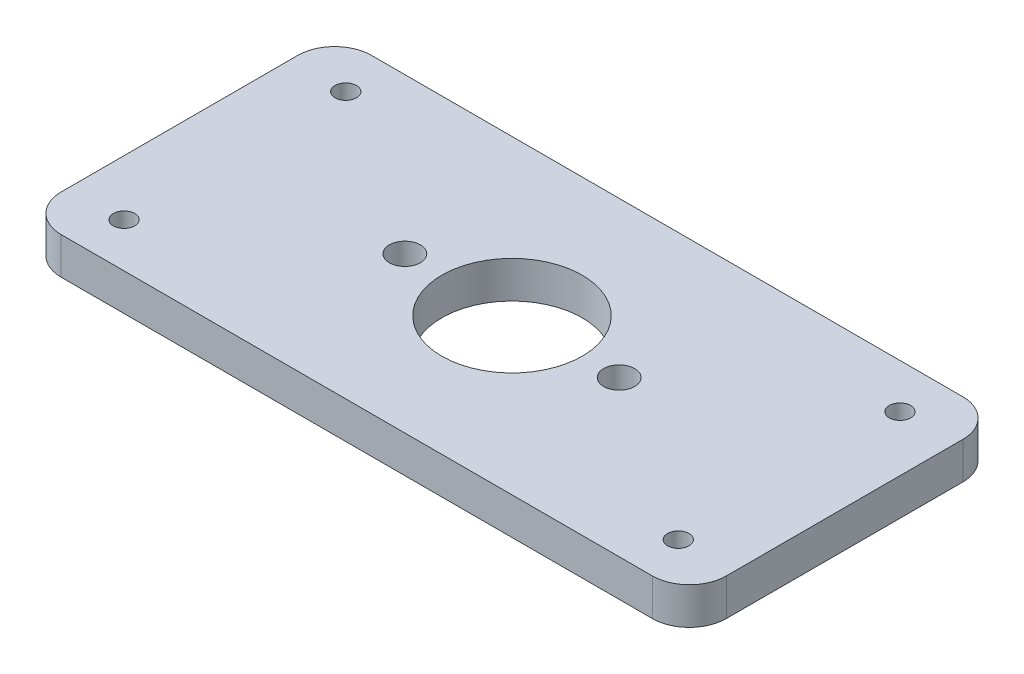
ISO-10303-21;
HEADER;
FILE_DESCRIPTION(('STEP AP214'),'2;1');
FILE_NAME('part.step','',(''),(''),'','','');
FILE_SCHEMA(('AUTOMOTIVE_DESIGN { 1 0 10303 214 1 1 1 1 }'));
ENDSEC;
DATA;
#1=APPLICATION_CONTEXT('core data for automotive mechanical design processes');
#2=APPLICATION_PROTOCOL_DEFINITION('international standard','automotive_design',2000,#1);
#3=PRODUCT_CONTEXT('',#1,'mechanical');
#4=PRODUCT('Part','Part','',(#3));
#5=PRODUCT_RELATED_PRODUCT_CATEGORY('part','',(#4));
#6=PRODUCT_DEFINITION_FORMATION('','',#4);
#7=PRODUCT_DEFINITION_CONTEXT('part definition',#1,'design');
#8=PRODUCT_DEFINITION('design','',#6,#7);
#9=PRODUCT_DEFINITION_SHAPE('','',#8);
#10=(LENGTH_UNIT() NAMED_UNIT(*) SI_UNIT(.MILLI.,.METRE.));
#11=(NAMED_UNIT(*) PLANE_ANGLE_UNIT() SI_UNIT($,.RADIAN.));
#12=(NAMED_UNIT(*) SI_UNIT($,.STERADIAN.) SOLID_ANGLE_UNIT());
#13=UNCERTAINTY_MEASURE_WITH_UNIT(LENGTH_MEASURE(1.E-05),#10,'distance_accuracy_value','');
#14=(GEOMETRIC_REPRESENTATION_CONTEXT(3) GLOBAL_UNCERTAINTY_ASSIGNED_CONTEXT((#13)) GLOBAL_UNIT_ASSIGNED_CONTEXT((#10,
#11,#12)) REPRESENTATION_CONTEXT('',''));
#15=CARTESIAN_POINT('',(0.,0.,0.));
#16=DIRECTION('',(0.,0.,1.));
#17=DIRECTION('',(1.,0.,0.));
#18=AXIS2_PLACEMENT_3D('',#15,#16,#17);
#19=CARTESIAN_POINT('',(0.,5.,0.));
#20=DIRECTION('',(0.,-1.,0.));
#21=DIRECTION('',(0.,0.,-1.));
#22=AXIS2_PLACEMENT_3D('',#19,#20,#21);
#23=PLANE('',#22);
#24=DIRECTION('',(0.,0.,-1.));
#25=VECTOR('',#24,1.);
#26=CARTESIAN_POINT('',(90.,5.,0.));
#27=LINE('',#26,#25);
#28=CARTESIAN_POINT('',(90.,5.,-5.));
#29=VERTEX_POINT('',#28);
#30=CARTESIAN_POINT('',(90.,5.,-37.));
#31=VERTEX_POINT('',#30);
#32=EDGE_CURVE('E206',#29,#31,#27,.T.);
#33=ORIENTED_EDGE('',*,*,#32,.T.);
#34=CARTESIAN_POINT('',(85.,5.,-37.));
#35=DIRECTION('',(0.,-1.,0.));
#36=DIRECTION('',(0.,0.,-1.));
#37=AXIS2_PLACEMENT_3D('',#34,#35,#36);
#38=CIRCLE('',#37,5.);
#39=CARTESIAN_POINT('',(85.,5.,-42.));
#40=VERTEX_POINT('',#39);
#41=EDGE_CURVE('E175',#31,#40,#38,.F.);
#42=ORIENTED_EDGE('',*,*,#41,.T.);
#43=DIRECTION('',(-1.,0.,0.));
#44=VECTOR('',#43,1.);
#45=CARTESIAN_POINT('',(0.,5.,-42.));
#46=LINE('',#45,#44);
#47=CARTESIAN_POINT('',(5.,5.,-42.));
#48=VERTEX_POINT('',#47);
#49=EDGE_CURVE('E133',#40,#48,#46,.T.);
#50=ORIENTED_EDGE('',*,*,#49,.T.);
#51=CARTESIAN_POINT('',(5.,5.,-37.));
#52=DIRECTION('',(0.,-1.,0.));
#53=DIRECTION('',(0.,0.,-1.));
#54=AXIS2_PLACEMENT_3D('',#51,#52,#53);
#55=CIRCLE('',#54,5.);
#56=CARTESIAN_POINT('',(0.,5.,-37.));
#57=VERTEX_POINT('',#56);
#58=EDGE_CURVE('E167',#48,#57,#55,.F.);
#59=ORIENTED_EDGE('',*,*,#58,.T.);
#60=DIRECTION('',(0.,0.,1.));
#61=VECTOR('',#60,1.);
#62=CARTESIAN_POINT('',(0.,5.,0.));
#63=LINE('',#62,#61);
#64=CARTESIAN_POINT('',(0.,5.,-5.));
#65=VERTEX_POINT('',#64);
#66=EDGE_CURVE('E142',#57,#65,#63,.T.);
#67=ORIENTED_EDGE('',*,*,#66,.T.);
#68=CARTESIAN_POINT('',(5.,5.,-5.));
#69=DIRECTION('',(0.,-1.,0.));
#70=DIRECTION('',(0.,0.,-1.));
#71=AXIS2_PLACEMENT_3D('',#68,#69,#70);
#72=CIRCLE('',#71,5.);
#73=CARTESIAN_POINT('',(5.,5.,0.));
#74=VERTEX_POINT('',#73);
#75=EDGE_CURVE('E68',#65,#74,#72,.F.);
#76=ORIENTED_EDGE('',*,*,#75,.T.);
#77=DIRECTION('',(1.,0.,0.));
#78=VECTOR('',#77,1.);
#79=CARTESIAN_POINT('',(0.,5.,0.));
#80=LINE('',#79,#78);
#81=CARTESIAN_POINT('',(85.,5.,0.));
#82=VERTEX_POINT('',#81);
#83=EDGE_CURVE('E147',#74,#82,#80,.T.);
#84=ORIENTED_EDGE('',*,*,#83,.T.);
#85=CARTESIAN_POINT('',(85.,5.,-5.));
#86=DIRECTION('',(0.,-1.,0.));
#87=DIRECTION('',(0.,0.,-1.));
#88=AXIS2_PLACEMENT_3D('',#85,#86,#87);
#89=CIRCLE('',#88,5.);
#90=EDGE_CURVE('E172',#82,#29,#89,.F.);
#91=ORIENTED_EDGE('',*,*,#90,.T.);
#92=EDGE_LOOP('',(#33,#42,#50,#59,#67,#76,#84,#91));
#93=FACE_BOUND('',#92,.T.);
#94=CARTESIAN_POINT('',(45.,5.,-21.));
#95=DIRECTION('',(0.,1.,0.));
#96=DIRECTION('',(0.,0.,1.));
#97=AXIS2_PLACEMENT_3D('',#94,#95,#96);
#98=CIRCLE('',#97,9.5);
#99=CARTESIAN_POINT('',(45.,5.,-11.5));
#100=VERTEX_POINT('',#99);
#101=EDGE_CURVE('E196',#100,#100,#98,.T.);
#102=ORIENTED_EDGE('',*,*,#101,.F.);
#103=EDGE_LOOP('',(#102));
#104=FACE_BOUND('',#103,.T.);
#105=CARTESIAN_POINT('',(59.5,5.,-21.));
#106=DIRECTION('',(0.,1.,0.));
#107=DIRECTION('',(0.,0.,1.));
#108=AXIS2_PLACEMENT_3D('',#105,#106,#107);
#109=CIRCLE('',#108,2.09999999999999);
#110=CARTESIAN_POINT('',(59.5,5.,-18.9));
#111=VERTEX_POINT('',#110);
#112=EDGE_CURVE('E214',#111,#111,#109,.T.);
#113=ORIENTED_EDGE('',*,*,#112,.F.);
#114=EDGE_LOOP('',(#113));
#115=FACE_BOUND('',#114,.T.);
#116=CARTESIAN_POINT('',(30.5,5.,-21.));
#117=DIRECTION('',(0.,1.,0.));
#118=DIRECTION('',(0.,0.,-1.));
#119=AXIS2_PLACEMENT_3D('',#116,#117,#118);
#120=CIRCLE('',#119,2.1);
#121=CARTESIAN_POINT('',(30.5,5.,-23.1));
#122=VERTEX_POINT('',#121);
#123=EDGE_CURVE('E220',#122,#122,#120,.T.);
#124=ORIENTED_EDGE('',*,*,#123,.F.);
#125=EDGE_LOOP('',(#124));
#126=FACE_BOUND('',#125,.T.);
#127=CARTESIAN_POINT('',(7.5,5.,-36.));
#128=DIRECTION('',(0.,1.,0.));
#129=DIRECTION('',(0.,0.,1.));
#130=AXIS2_PLACEMENT_3D('',#127,#128,#129);
#131=CIRCLE('',#130,1.45);
#132=CARTESIAN_POINT('',(7.5,5.,-34.55));
#133=VERTEX_POINT('',#132);
#134=EDGE_CURVE('E228',#133,#133,#131,.T.);
#135=ORIENTED_EDGE('',*,*,#134,.F.);
#136=EDGE_LOOP('',(#135));
#137=FACE_BOUND('',#136,.T.);
#138=CARTESIAN_POINT('',(7.5,5.,-6.));
#139=DIRECTION('',(0.,1.,0.));
#140=DIRECTION('',(0.,0.,-1.));
#141=AXIS2_PLACEMENT_3D('',#138,#139,#140);
#142=CIRCLE('',#141,1.45);
#143=CARTESIAN_POINT('',(7.5,5.,-7.45));
#144=VERTEX_POINT('',#143);
#145=EDGE_CURVE('E236',#144,#144,#142,.T.);
#146=ORIENTED_EDGE('',*,*,#145,.F.);
#147=EDGE_LOOP('',(#146));
#148=FACE_BOUND('',#147,.T.);
#149=CARTESIAN_POINT('',(82.5,5.,-6.));
#150=DIRECTION('',(0.,1.,0.));
#151=DIRECTION('',(0.,0.,1.));
#152=AXIS2_PLACEMENT_3D('',#149,#150,#151);
#153=CIRCLE('',#152,1.45);
#154=CARTESIAN_POINT('',(82.5,5.,-4.55));
#155=VERTEX_POINT('',#154);
#156=EDGE_CURVE('E244',#155,#155,#153,.T.);
#157=ORIENTED_EDGE('',*,*,#156,.F.);
#158=EDGE_LOOP('',(#157));
#159=FACE_BOUND('',#158,.T.);
#160=CARTESIAN_POINT('',(82.5,5.,-36.));
#161=DIRECTION('',(0.,1.,0.));
#162=DIRECTION('',(0.,0.,-1.));
#163=AXIS2_PLACEMENT_3D('',#160,#161,#162);
#164=CIRCLE('',#163,1.45);
#165=CARTESIAN_POINT('',(82.5,5.,-37.45));
#166=VERTEX_POINT('',#165);
#167=EDGE_CURVE('E252',#166,#166,#164,.T.);
#168=ORIENTED_EDGE('',*,*,#167,.F.);
#169=EDGE_LOOP('',(#168));
#170=FACE_BOUND('',#169,.T.);
#171=ADVANCED_FACE('F45',(#93,#104,#115,#126,#137,#148,#159,#170),#23,.F.);
#172=CARTESIAN_POINT('',(0.,0.,0.));
#173=DIRECTION('',(0.,-1.,0.));
#174=DIRECTION('',(0.,0.,-1.));
#175=AXIS2_PLACEMENT_3D('',#172,#173,#174);
#176=PLANE('',#175);
#177=CARTESIAN_POINT('',(82.5,0.,-6.));
#178=DIRECTION('',(0.,1.,0.));
#179=DIRECTION('',(0.,0.,1.));
#180=AXIS2_PLACEMENT_3D('',#177,#178,#179);
#181=CIRCLE('',#180,1.45);
#182=CARTESIAN_POINT('',(82.5,0.,-4.55));
#183=VERTEX_POINT('',#182);
#184=EDGE_CURVE('E248',#183,#183,#181,.T.);
#185=ORIENTED_EDGE('',*,*,#184,.T.);
#186=EDGE_LOOP('',(#185));
#187=FACE_BOUND('',#186,.T.);
#188=CARTESIAN_POINT('',(7.5,0.,-36.));
#189=DIRECTION('',(0.,1.,0.));
#190=DIRECTION('',(0.,0.,1.));
#191=AXIS2_PLACEMENT_3D('',#188,#189,#190);
#192=CIRCLE('',#191,1.45);
#193=CARTESIAN_POINT('',(7.5,0.,-34.55));
#194=VERTEX_POINT('',#193);
#195=EDGE_CURVE('E232',#194,#194,#192,.T.);
#196=ORIENTED_EDGE('',*,*,#195,.T.);
#197=EDGE_LOOP('',(#196));
#198=FACE_BOUND('',#197,.T.);
#199=CARTESIAN_POINT('',(59.5,0.,-21.));
#200=DIRECTION('',(0.,1.,0.));
#201=DIRECTION('',(0.,0.,1.));
#202=AXIS2_PLACEMENT_3D('',#199,#200,#201);
#203=CIRCLE('',#202,2.09999999999999);
#204=CARTESIAN_POINT('',(59.5,0.,-18.9));
#205=VERTEX_POINT('',#204);
#206=EDGE_CURVE('E216',#205,#205,#203,.T.);
#207=ORIENTED_EDGE('',*,*,#206,.T.);
#208=EDGE_LOOP('',(#207));
#209=FACE_BOUND('',#208,.T.);
#210=DIRECTION('',(-1.,0.,0.));
#211=VECTOR('',#210,1.);
#212=CARTESIAN_POINT('',(0.,0.,-42.));
#213=LINE('',#212,#211);
#214=CARTESIAN_POINT('',(85.,0.,-42.));
#215=VERTEX_POINT('',#214);
#216=CARTESIAN_POINT('',(5.,0.,-42.));
#217=VERTEX_POINT('',#216);
#218=EDGE_CURVE('E130',#215,#217,#213,.T.);
#219=ORIENTED_EDGE('',*,*,#218,.F.);
#220=CARTESIAN_POINT('',(85.,0.,-37.));
#221=DIRECTION('',(0.,-1.,0.));
#222=DIRECTION('',(0.,0.,-1.));
#223=AXIS2_PLACEMENT_3D('',#220,#221,#222);
#224=CIRCLE('',#223,5.);
#225=CARTESIAN_POINT('',(90.,0.,-37.));
#226=VERTEX_POINT('',#225);
#227=EDGE_CURVE('E112',#215,#226,#224,.T.);
#228=ORIENTED_EDGE('',*,*,#227,.T.);
#229=DIRECTION('',(0.,0.,-1.));
#230=VECTOR('',#229,1.);
#231=CARTESIAN_POINT('',(90.,0.,0.));
#232=LINE('',#231,#230);
#233=CARTESIAN_POINT('',(90.,0.,-5.));
#234=VERTEX_POINT('',#233);
#235=EDGE_CURVE('E143',#234,#226,#232,.T.);
#236=ORIENTED_EDGE('',*,*,#235,.F.);
#237=CARTESIAN_POINT('',(85.,0.,-5.));
#238=DIRECTION('',(0.,-1.,0.));
#239=DIRECTION('',(0.,0.,-1.));
#240=AXIS2_PLACEMENT_3D('',#237,#238,#239);
#241=CIRCLE('',#240,5.);
#242=CARTESIAN_POINT('',(85.,0.,0.));
#243=VERTEX_POINT('',#242);
#244=EDGE_CURVE('E124',#234,#243,#241,.T.);
#245=ORIENTED_EDGE('',*,*,#244,.T.);
#246=DIRECTION('',(1.,0.,0.));
#247=VECTOR('',#246,1.);
#248=CARTESIAN_POINT('',(0.,0.,0.));
#249=LINE('',#248,#247);
#250=CARTESIAN_POINT('',(5.,0.,0.));
#251=VERTEX_POINT('',#250);
#252=EDGE_CURVE('E149',#251,#243,#249,.T.);
#253=ORIENTED_EDGE('',*,*,#252,.F.);
#254=CARTESIAN_POINT('',(5.,0.,-5.));
#255=DIRECTION('',(0.,-1.,0.));
#256=DIRECTION('',(0.,0.,-1.));
#257=AXIS2_PLACEMENT_3D('',#254,#255,#256);
#258=CIRCLE('',#257,5.);
#259=CARTESIAN_POINT('',(0.,0.,-5.));
#260=VERTEX_POINT('',#259);
#261=EDGE_CURVE('E157',#251,#260,#258,.T.);
#262=ORIENTED_EDGE('',*,*,#261,.T.);
#263=DIRECTION('',(0.,0.,1.));
#264=VECTOR('',#263,1.);
#265=CARTESIAN_POINT('',(0.,0.,0.));
#266=LINE('',#265,#264);
#267=CARTESIAN_POINT('',(0.,0.,-37.));
#268=VERTEX_POINT('',#267);
#269=EDGE_CURVE('E190',#268,#260,#266,.T.);
#270=ORIENTED_EDGE('',*,*,#269,.F.);
#271=CARTESIAN_POINT('',(5.,0.,-37.));
#272=DIRECTION('',(0.,-1.,0.));
#273=DIRECTION('',(0.,0.,-1.));
#274=AXIS2_PLACEMENT_3D('',#271,#272,#273);
#275=CIRCLE('',#274,5.);
#276=EDGE_CURVE('E135',#268,#217,#275,.T.);
#277=ORIENTED_EDGE('',*,*,#276,.T.);
#278=EDGE_LOOP('',(#219,#228,#236,#245,#253,#262,#270,#277));
#279=FACE_BOUND('',#278,.T.);
#280=CARTESIAN_POINT('',(45.,0.,-21.));
#281=DIRECTION('',(0.,1.,0.));
#282=DIRECTION('',(0.,0.,1.));
#283=AXIS2_PLACEMENT_3D('',#280,#281,#282);
#284=CIRCLE('',#283,9.5);
#285=CARTESIAN_POINT('',(45.,0.,-11.5));
#286=VERTEX_POINT('',#285);
#287=EDGE_CURVE('E201',#286,#286,#284,.T.);
#288=ORIENTED_EDGE('',*,*,#287,.T.);
#289=EDGE_LOOP('',(#288));
#290=FACE_BOUND('',#289,.T.);
#291=CARTESIAN_POINT('',(30.5,0.,-21.));
#292=DIRECTION('',(0.,1.,0.));
#293=DIRECTION('',(0.,0.,-1.));
#294=AXIS2_PLACEMENT_3D('',#291,#292,#293);
#295=CIRCLE('',#294,2.1);
#296=CARTESIAN_POINT('',(30.5,0.,-23.1));
#297=VERTEX_POINT('',#296);
#298=EDGE_CURVE('E224',#297,#297,#295,.T.);
#299=ORIENTED_EDGE('',*,*,#298,.T.);
#300=EDGE_LOOP('',(#299));
#301=FACE_BOUND('',#300,.T.);
#302=CARTESIAN_POINT('',(7.5,0.,-6.));
#303=DIRECTION('',(0.,1.,0.));
#304=DIRECTION('',(0.,0.,-1.));
#305=AXIS2_PLACEMENT_3D('',#302,#303,#304);
#306=CIRCLE('',#305,1.45);
#307=CARTESIAN_POINT('',(7.5,0.,-7.45));
#308=VERTEX_POINT('',#307);
#309=EDGE_CURVE('E240',#308,#308,#306,.T.);
#310=ORIENTED_EDGE('',*,*,#309,.T.);
#311=EDGE_LOOP('',(#310));
#312=FACE_BOUND('',#311,.T.);
#313=CARTESIAN_POINT('',(82.5,0.,-36.));
#314=DIRECTION('',(0.,1.,0.));
#315=DIRECTION('',(0.,0.,-1.));
#316=AXIS2_PLACEMENT_3D('',#313,#314,#315);
#317=CIRCLE('',#316,1.45);
#318=CARTESIAN_POINT('',(82.5,0.,-37.45));
#319=VERTEX_POINT('',#318);
#320=EDGE_CURVE('E256',#319,#319,#317,.T.);
#321=ORIENTED_EDGE('',*,*,#320,.T.);
#322=EDGE_LOOP('',(#321));
#323=FACE_BOUND('',#322,.T.);
#324=ADVANCED_FACE('F138',(#187,#198,#209,#279,#290,#301,#312,#323),#176,.T.);
#325=CARTESIAN_POINT('',(0.,5.,0.));
#326=DIRECTION('',(1.,0.,0.));
#327=DIRECTION('',(0.,0.,-1.));
#328=AXIS2_PLACEMENT_3D('',#325,#326,#327);
#329=PLANE('',#328);
#330=ORIENTED_EDGE('',*,*,#269,.T.);
#331=DIRECTION('',(0.,-1.,0.));
#332=VECTOR('',#331,1.);
#333=CARTESIAN_POINT('',(0.,5.,-5.));
#334=LINE('',#333,#332);
#335=EDGE_CURVE('E11',#260,#65,#334,.F.);
#336=ORIENTED_EDGE('',*,*,#335,.T.);
#337=ORIENTED_EDGE('',*,*,#66,.F.);
#338=DIRECTION('',(0.,-1.,0.));
#339=VECTOR('',#338,1.);
#340=CARTESIAN_POINT('',(0.,5.,-37.));
#341=LINE('',#340,#339);
#342=EDGE_CURVE('E54',#57,#268,#341,.T.);
#343=ORIENTED_EDGE('',*,*,#342,.T.);
#344=EDGE_LOOP('',(#330,#336,#337,#343));
#345=FACE_BOUND('',#344,.T.);
#346=ADVANCED_FACE('F189',(#345),#329,.F.);
#347=CARTESIAN_POINT('',(0.,5.,0.));
#348=DIRECTION('',(0.,0.,-1.));
#349=DIRECTION('',(-1.,0.,0.));
#350=AXIS2_PLACEMENT_3D('',#347,#348,#349);
#351=PLANE('',#350);
#352=ORIENTED_EDGE('',*,*,#252,.T.);
#353=DIRECTION('',(0.,-1.,0.));
#354=VECTOR('',#353,1.);
#355=CARTESIAN_POINT('',(85.,5.,0.));
#356=LINE('',#355,#354);
#357=EDGE_CURVE('E61',#243,#82,#356,.F.);
#358=ORIENTED_EDGE('',*,*,#357,.T.);
#359=ORIENTED_EDGE('',*,*,#83,.F.);
#360=DIRECTION('',(0.,-1.,0.));
#361=VECTOR('',#360,1.);
#362=CARTESIAN_POINT('',(5.,5.,0.));
#363=LINE('',#362,#361);
#364=EDGE_CURVE('E178',#74,#251,#363,.T.);
#365=ORIENTED_EDGE('',*,*,#364,.T.);
#366=EDGE_LOOP('',(#352,#358,#359,#365));
#367=FACE_BOUND('',#366,.T.);
#368=ADVANCED_FACE('F285',(#367),#351,.F.);
#369=CARTESIAN_POINT('',(90.,5.,0.));
#370=DIRECTION('',(-1.,0.,0.));
#371=DIRECTION('',(0.,0.,1.));
#372=AXIS2_PLACEMENT_3D('',#369,#370,#371);
#373=PLANE('',#372);
#374=ORIENTED_EDGE('',*,*,#235,.T.);
#375=DIRECTION('',(0.,-1.,0.));
#376=VECTOR('',#375,1.);
#377=CARTESIAN_POINT('',(90.,5.,-37.));
#378=LINE('',#377,#376);
#379=EDGE_CURVE('E117',#226,#31,#378,.F.);
#380=ORIENTED_EDGE('',*,*,#379,.T.);
#381=ORIENTED_EDGE('',*,*,#32,.F.);
#382=DIRECTION('',(0.,-1.,0.));
#383=VECTOR('',#382,1.);
#384=CARTESIAN_POINT('',(90.,5.,-5.));
#385=LINE('',#384,#383);
#386=EDGE_CURVE('E123',#29,#234,#385,.T.);
#387=ORIENTED_EDGE('',*,*,#386,.T.);
#388=EDGE_LOOP('',(#374,#380,#381,#387));
#389=FACE_BOUND('',#388,.T.);
#390=ADVANCED_FACE('F282',(#389),#373,.F.);
#391=CARTESIAN_POINT('',(0.,5.,-42.));
#392=DIRECTION('',(0.,0.,1.));
#393=DIRECTION('',(1.,0.,0.));
#394=AXIS2_PLACEMENT_3D('',#391,#392,#393);
#395=PLANE('',#394);
#396=ORIENTED_EDGE('',*,*,#49,.F.);
#397=DIRECTION('',(0.,-1.,0.));
#398=VECTOR('',#397,1.);
#399=CARTESIAN_POINT('',(85.,5.,-42.));
#400=LINE('',#399,#398);
#401=EDGE_CURVE('E116',#40,#215,#400,.T.);
#402=ORIENTED_EDGE('',*,*,#401,.T.);
#403=ORIENTED_EDGE('',*,*,#218,.T.);
#404=DIRECTION('',(0.,-1.,0.));
#405=VECTOR('',#404,1.);
#406=CARTESIAN_POINT('',(5.,5.,-42.));
#407=LINE('',#406,#405);
#408=EDGE_CURVE('E136',#217,#48,#407,.F.);
#409=ORIENTED_EDGE('',*,*,#408,.T.);
#410=EDGE_LOOP('',(#396,#402,#403,#409));
#411=FACE_BOUND('',#410,.T.);
#412=ADVANCED_FACE('F129',(#411),#395,.F.);
#413=CARTESIAN_POINT('',(45.,5.,-21.));
#414=DIRECTION('',(0.,-1.,0.));
#415=DIRECTION('',(0.,0.,-1.));
#416=AXIS2_PLACEMENT_3D('',#413,#414,#415);
#417=CYLINDRICAL_SURFACE('',#416,9.5);
#418=ORIENTED_EDGE('',*,*,#101,.T.);
#419=EDGE_LOOP('',(#418));
#420=FACE_BOUND('',#419,.T.);
#421=ORIENTED_EDGE('',*,*,#287,.F.);
#422=EDGE_LOOP('',(#421));
#423=FACE_BOUND('',#422,.T.);
#424=ADVANCED_FACE('F277',(#420,#423),#417,.F.);
#425=CARTESIAN_POINT('',(59.5,5.,-21.));
#426=DIRECTION('',(0.,-1.,0.));
#427=DIRECTION('',(0.,0.,-1.));
#428=AXIS2_PLACEMENT_3D('',#425,#426,#427);
#429=CYLINDRICAL_SURFACE('',#428,2.09999999999999);
#430=ORIENTED_EDGE('',*,*,#112,.T.);
#431=EDGE_LOOP('',(#430));
#432=FACE_BOUND('',#431,.T.);
#433=ORIENTED_EDGE('',*,*,#206,.F.);
#434=EDGE_LOOP('',(#433));
#435=FACE_BOUND('',#434,.T.);
#436=ADVANCED_FACE('F372',(#432,#435),#429,.F.);
#437=CARTESIAN_POINT('',(30.5,5.,-21.));
#438=DIRECTION('',(0.,-1.,0.));
#439=DIRECTION('',(0.,0.,-1.));
#440=AXIS2_PLACEMENT_3D('',#437,#438,#439);
#441=CYLINDRICAL_SURFACE('',#440,2.1);
#442=ORIENTED_EDGE('',*,*,#123,.T.);
#443=EDGE_LOOP('',(#442));
#444=FACE_BOUND('',#443,.T.);
#445=ORIENTED_EDGE('',*,*,#298,.F.);
#446=EDGE_LOOP('',(#445));
#447=FACE_BOUND('',#446,.T.);
#448=ADVANCED_FACE('F362',(#444,#447),#441,.F.);
#449=CARTESIAN_POINT('',(7.5,5.,-36.));
#450=DIRECTION('',(0.,-1.,0.));
#451=DIRECTION('',(0.,0.,-1.));
#452=AXIS2_PLACEMENT_3D('',#449,#450,#451);
#453=CYLINDRICAL_SURFACE('',#452,1.45);
#454=ORIENTED_EDGE('',*,*,#134,.T.);
#455=EDGE_LOOP('',(#454));
#456=FACE_BOUND('',#455,.T.);
#457=ORIENTED_EDGE('',*,*,#195,.F.);
#458=EDGE_LOOP('',(#457));
#459=FACE_BOUND('',#458,.T.);
#460=ADVANCED_FACE('F352',(#456,#459),#453,.F.);
#461=CARTESIAN_POINT('',(7.5,5.,-6.));
#462=DIRECTION('',(0.,-1.,0.));
#463=DIRECTION('',(0.,0.,-1.));
#464=AXIS2_PLACEMENT_3D('',#461,#462,#463);
#465=CYLINDRICAL_SURFACE('',#464,1.45);
#466=ORIENTED_EDGE('',*,*,#145,.T.);
#467=EDGE_LOOP('',(#466));
#468=FACE_BOUND('',#467,.T.);
#469=ORIENTED_EDGE('',*,*,#309,.F.);
#470=EDGE_LOOP('',(#469));
#471=FACE_BOUND('',#470,.T.);
#472=ADVANCED_FACE('F342',(#468,#471),#465,.F.);
#473=CARTESIAN_POINT('',(82.5,5.,-6.));
#474=DIRECTION('',(0.,-1.,0.));
#475=DIRECTION('',(0.,0.,-1.));
#476=AXIS2_PLACEMENT_3D('',#473,#474,#475);
#477=CYLINDRICAL_SURFACE('',#476,1.45);
#478=ORIENTED_EDGE('',*,*,#156,.T.);
#479=EDGE_LOOP('',(#478));
#480=FACE_BOUND('',#479,.T.);
#481=ORIENTED_EDGE('',*,*,#184,.F.);
#482=EDGE_LOOP('',(#481));
#483=FACE_BOUND('',#482,.T.);
#484=ADVANCED_FACE('F333',(#480,#483),#477,.F.);
#485=CARTESIAN_POINT('',(82.5,5.,-36.));
#486=DIRECTION('',(0.,-1.,0.));
#487=DIRECTION('',(0.,0.,-1.));
#488=AXIS2_PLACEMENT_3D('',#485,#486,#487);
#489=CYLINDRICAL_SURFACE('',#488,1.45);
#490=ORIENTED_EDGE('',*,*,#167,.T.);
#491=EDGE_LOOP('',(#490));
#492=FACE_BOUND('',#491,.T.);
#493=ORIENTED_EDGE('',*,*,#320,.F.);
#494=EDGE_LOOP('',(#493));
#495=FACE_BOUND('',#494,.T.);
#496=ADVANCED_FACE('F264',(#492,#495),#489,.F.);
#497=CARTESIAN_POINT('',(85.,5.,-37.));
#498=DIRECTION('',(0.,-1.,0.));
#499=DIRECTION('',(0.,0.,-1.));
#500=AXIS2_PLACEMENT_3D('',#497,#498,#499);
#501=CYLINDRICAL_SURFACE('',#500,5.);
#502=ORIENTED_EDGE('',*,*,#41,.F.);
#503=ORIENTED_EDGE('',*,*,#379,.F.);
#504=ORIENTED_EDGE('',*,*,#227,.F.);
#505=ORIENTED_EDGE('',*,*,#401,.F.);
#506=EDGE_LOOP('',(#502,#503,#504,#505));
#507=FACE_BOUND('',#506,.T.);
#508=ADVANCED_FACE('F115',(#507),#501,.T.);
#509=CARTESIAN_POINT('',(85.,5.,-5.));
#510=DIRECTION('',(0.,-1.,0.));
#511=DIRECTION('',(0.,0.,-1.));
#512=AXIS2_PLACEMENT_3D('',#509,#510,#511);
#513=CYLINDRICAL_SURFACE('',#512,5.);
#514=ORIENTED_EDGE('',*,*,#90,.F.);
#515=ORIENTED_EDGE('',*,*,#357,.F.);
#516=ORIENTED_EDGE('',*,*,#244,.F.);
#517=ORIENTED_EDGE('',*,*,#386,.F.);
#518=EDGE_LOOP('',(#514,#515,#516,#517));
#519=FACE_BOUND('',#518,.T.);
#520=ADVANCED_FACE('F293',(#519),#513,.T.);
#521=CARTESIAN_POINT('',(5.,5.,-5.));
#522=DIRECTION('',(0.,-1.,0.));
#523=DIRECTION('',(0.,0.,-1.));
#524=AXIS2_PLACEMENT_3D('',#521,#522,#523);
#525=CYLINDRICAL_SURFACE('',#524,5.);
#526=ORIENTED_EDGE('',*,*,#75,.F.);
#527=ORIENTED_EDGE('',*,*,#335,.F.);
#528=ORIENTED_EDGE('',*,*,#261,.F.);
#529=ORIENTED_EDGE('',*,*,#364,.F.);
#530=EDGE_LOOP('',(#526,#527,#528,#529));
#531=FACE_BOUND('',#530,.T.);
#532=ADVANCED_FACE('F295',(#531),#525,.T.);
#533=CARTESIAN_POINT('',(5.,5.,-37.));
#534=DIRECTION('',(0.,-1.,0.));
#535=DIRECTION('',(0.,0.,-1.));
#536=AXIS2_PLACEMENT_3D('',#533,#534,#535);
#537=CYLINDRICAL_SURFACE('',#536,5.);
#538=ORIENTED_EDGE('',*,*,#58,.F.);
#539=ORIENTED_EDGE('',*,*,#408,.F.);
#540=ORIENTED_EDGE('',*,*,#276,.F.);
#541=ORIENTED_EDGE('',*,*,#342,.F.);
#542=EDGE_LOOP('',(#538,#539,#540,#541));
#543=FACE_BOUND('',#542,.T.);
#544=ADVANCED_FACE('F47',(#543),#537,.T.);
#545=CLOSED_SHELL('',(#171,#324,#346,#368,#390,#412,#424,#436,#448,#460,#472,#484,#496,#508,
#520,#532,#544));
#546=MANIFOLD_SOLID_BREP('B2',#545);
#547=ADVANCED_BREP_SHAPE_REPRESENTATION('',(#18,#546),#14);
#548=SHAPE_DEFINITION_REPRESENTATION(#9,#547);
ENDSEC;
END-ISO-10303-21;
